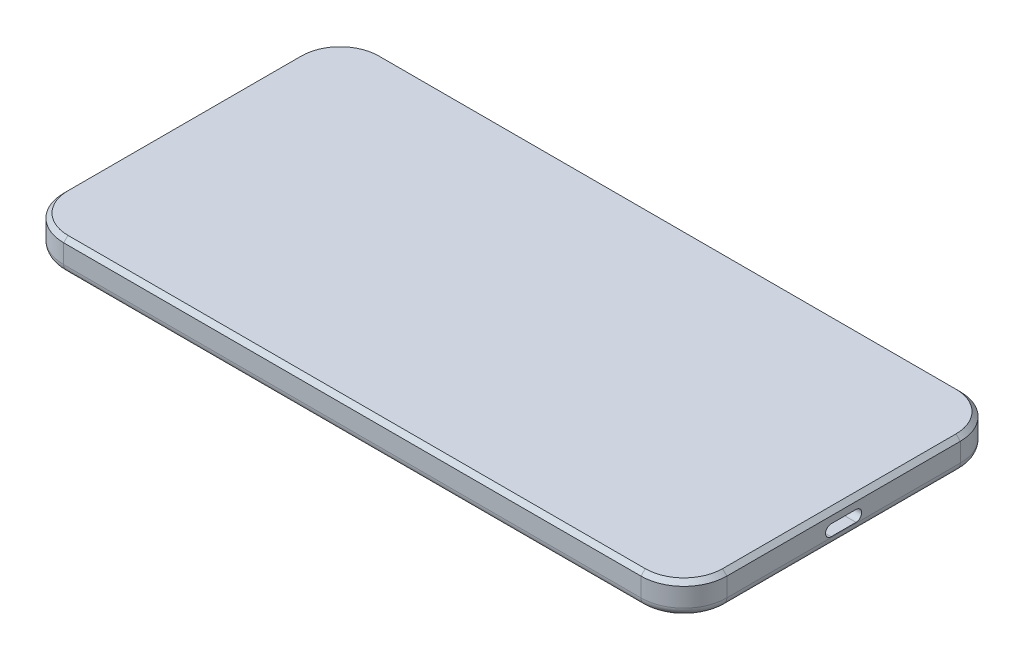
ISO-10303-21;
HEADER;
FILE_DESCRIPTION(('STEP AP214'),'2;1');
FILE_NAME('part.step','',(''),(''),'','','');
FILE_SCHEMA(('AUTOMOTIVE_DESIGN { 1 0 10303 214 1 1 1 1 }'));
ENDSEC;
DATA;
#1=APPLICATION_CONTEXT('core data for automotive mechanical design processes');
#2=APPLICATION_PROTOCOL_DEFINITION('international standard','automotive_design',2000,#1);
#3=PRODUCT_CONTEXT('',#1,'mechanical');
#4=PRODUCT('Part','Part','',(#3));
#5=PRODUCT_RELATED_PRODUCT_CATEGORY('part','',(#4));
#6=PRODUCT_DEFINITION_FORMATION('','',#4);
#7=PRODUCT_DEFINITION_CONTEXT('part definition',#1,'design');
#8=PRODUCT_DEFINITION('design','',#6,#7);
#9=PRODUCT_DEFINITION_SHAPE('','',#8);
#10=(LENGTH_UNIT() NAMED_UNIT(*) SI_UNIT(.MILLI.,.METRE.));
#11=(NAMED_UNIT(*) PLANE_ANGLE_UNIT() SI_UNIT($,.RADIAN.));
#12=(NAMED_UNIT(*) SI_UNIT($,.STERADIAN.) SOLID_ANGLE_UNIT());
#13=UNCERTAINTY_MEASURE_WITH_UNIT(LENGTH_MEASURE(1.E-05),#10,'distance_accuracy_value','');
#14=(GEOMETRIC_REPRESENTATION_CONTEXT(3) GLOBAL_UNCERTAINTY_ASSIGNED_CONTEXT((#13)) GLOBAL_UNIT_ASSIGNED_CONTEXT((#10,
#11,#12)) REPRESENTATION_CONTEXT('',''));
#15=CARTESIAN_POINT('',(0.,0.,0.));
#16=DIRECTION('',(0.,0.,1.));
#17=DIRECTION('',(1.,0.,0.));
#18=AXIS2_PLACEMENT_3D('',#15,#16,#17);
#19=CARTESIAN_POINT('',(0.,0.,0.));
#20=DIRECTION('',(0.,1.,0.));
#21=DIRECTION('',(0.,0.,1.));
#22=AXIS2_PLACEMENT_3D('',#19,#20,#21);
#23=PLANE('',#22);
#24=DIRECTION('',(-1.,0.,0.));
#25=VECTOR('',#24,1.);
#26=CARTESIAN_POINT('',(0.,0.,-35.2));
#27=LINE('',#26,#25);
#28=CARTESIAN_POINT('',(-67.25,0.,-35.2));
#29=VERTEX_POINT('',#28);
#30=CARTESIAN_POINT('',(67.25,0.,-35.2));
#31=VERTEX_POINT('',#30);
#32=EDGE_CURVE('E329',#29,#31,#27,.F.);
#33=ORIENTED_EDGE('',*,*,#32,.T.);
#34=CARTESIAN_POINT('',(67.25,0.,-27.2));
#35=DIRECTION('',(0.,1.,0.));
#36=DIRECTION('',(0.,0.,1.));
#37=AXIS2_PLACEMENT_3D('',#34,#35,#36);
#38=CIRCLE('',#37,8.);
#39=CARTESIAN_POINT('',(75.25,0.,-27.2));
#40=VERTEX_POINT('',#39);
#41=EDGE_CURVE('E365',#31,#40,#38,.F.);
#42=ORIENTED_EDGE('',*,*,#41,.T.);
#43=DIRECTION('',(0.,0.,-1.));
#44=VECTOR('',#43,1.);
#45=CARTESIAN_POINT('',(75.25,0.,0.));
#46=LINE('',#45,#44);
#47=CARTESIAN_POINT('',(75.25,0.,27.2));
#48=VERTEX_POINT('',#47);
#49=EDGE_CURVE('E363',#40,#48,#46,.F.);
#50=ORIENTED_EDGE('',*,*,#49,.T.);
#51=CARTESIAN_POINT('',(67.25,0.,27.2));
#52=DIRECTION('',(0.,1.,0.));
#53=DIRECTION('',(0.,0.,1.));
#54=AXIS2_PLACEMENT_3D('',#51,#52,#53);
#55=CIRCLE('',#54,8.);
#56=CARTESIAN_POINT('',(67.25,0.,35.2));
#57=VERTEX_POINT('',#56);
#58=EDGE_CURVE('E361',#48,#57,#55,.F.);
#59=ORIENTED_EDGE('',*,*,#58,.T.);
#60=DIRECTION('',(1.,0.,0.));
#61=VECTOR('',#60,1.);
#62=CARTESIAN_POINT('',(0.,0.,35.2));
#63=LINE('',#62,#61);
#64=CARTESIAN_POINT('',(-67.25,0.,35.2));
#65=VERTEX_POINT('',#64);
#66=EDGE_CURVE('E359',#57,#65,#63,.F.);
#67=ORIENTED_EDGE('',*,*,#66,.T.);
#68=CARTESIAN_POINT('',(-67.25,0.,27.2));
#69=DIRECTION('',(0.,1.,0.));
#70=DIRECTION('',(0.,0.,1.));
#71=AXIS2_PLACEMENT_3D('',#68,#69,#70);
#72=CIRCLE('',#71,8.);
#73=CARTESIAN_POINT('',(-75.25,0.,27.2));
#74=VERTEX_POINT('',#73);
#75=EDGE_CURVE('E357',#65,#74,#72,.F.);
#76=ORIENTED_EDGE('',*,*,#75,.T.);
#77=DIRECTION('',(0.,0.,1.));
#78=VECTOR('',#77,1.);
#79=CARTESIAN_POINT('',(-75.25,0.,0.));
#80=LINE('',#79,#78);
#81=CARTESIAN_POINT('',(-75.25,0.,-27.2));
#82=VERTEX_POINT('',#81);
#83=EDGE_CURVE('E355',#74,#82,#80,.F.);
#84=ORIENTED_EDGE('',*,*,#83,.T.);
#85=CARTESIAN_POINT('',(-67.25,0.,-27.2));
#86=DIRECTION('',(0.,1.,0.));
#87=DIRECTION('',(0.,0.,1.));
#88=AXIS2_PLACEMENT_3D('',#85,#86,#87);
#89=CIRCLE('',#88,8.);
#90=EDGE_CURVE('E353',#82,#29,#89,.F.);
#91=ORIENTED_EDGE('',*,*,#90,.T.);
#92=EDGE_LOOP('',(#33,#42,#50,#59,#67,#76,#84,#91));
#93=FACE_BOUND('',#92,.T.);
#94=CARTESIAN_POINT('',(-68.95,0.,-13.75));
#95=DIRECTION('',(0.,-1.,0.));
#96=DIRECTION('',(0.,0.,-1.));
#97=AXIS2_PLACEMENT_3D('',#94,#95,#96);
#98=CIRCLE('',#97,4.3);
#99=CARTESIAN_POINT('',(-64.65,0.,-13.75));
#100=VERTEX_POINT('',#99);
#101=CARTESIAN_POINT('',(-73.25,0.,-13.75));
#102=VERTEX_POINT('',#101);
#103=EDGE_CURVE('E252',#100,#102,#98,.T.);
#104=ORIENTED_EDGE('',*,*,#103,.F.);
#105=DIRECTION('',(0.,0.,-1.));
#106=VECTOR('',#105,1.);
#107=CARTESIAN_POINT('',(-64.65,0.,0.));
#108=LINE('',#107,#106);
#109=CARTESIAN_POINT('',(-64.65,0.,-23.65));
#110=VERTEX_POINT('',#109);
#111=EDGE_CURVE('E249',#100,#110,#108,.T.);
#112=ORIENTED_EDGE('',*,*,#111,.T.);
#113=CARTESIAN_POINT('',(-68.95,0.,-23.65));
#114=DIRECTION('',(0.,-1.,0.));
#115=DIRECTION('',(0.,0.,-1.));
#116=AXIS2_PLACEMENT_3D('',#113,#114,#115);
#117=CIRCLE('',#116,4.3);
#118=CARTESIAN_POINT('',(-73.25,0.,-23.65));
#119=VERTEX_POINT('',#118);
#120=EDGE_CURVE('E258',#119,#110,#117,.T.);
#121=ORIENTED_EDGE('',*,*,#120,.F.);
#122=DIRECTION('',(0.,0.,1.));
#123=VECTOR('',#122,1.);
#124=CARTESIAN_POINT('',(-73.25,0.,-1.02681611810344E-13));
#125=LINE('',#124,#123);
#126=EDGE_CURVE('E255',#119,#102,#125,.T.);
#127=ORIENTED_EDGE('',*,*,#126,.T.);
#128=EDGE_LOOP('',(#104,#112,#121,#127));
#129=FACE_BOUND('',#128,.T.);
#130=ADVANCED_FACE('F36',(#93,#129),#23,.F.);
#131=CARTESIAN_POINT('',(77.25,7.4,-37.2));
#132=DIRECTION('',(-1.,0.,0.));
#133=DIRECTION('',(0.,0.,1.));
#134=AXIS2_PLACEMENT_3D('',#131,#132,#133);
#135=PLANE('',#134);
#136=DIRECTION('',(0.,0.,-1.));
#137=VECTOR('',#136,1.);
#138=CARTESIAN_POINT('',(77.25,2.20000000000001,2.90000000000002));
#139=LINE('',#138,#137);
#140=CARTESIAN_POINT('',(77.25,2.20000000000001,2.90000000000001));
#141=VERTEX_POINT('',#140);
#142=CARTESIAN_POINT('',(77.25,2.20000000000001,-2.89999999999999));
#143=VERTEX_POINT('',#142);
#144=EDGE_CURVE('E239',#141,#143,#139,.T.);
#145=ORIENTED_EDGE('',*,*,#144,.F.);
#146=CARTESIAN_POINT('',(77.25,3.5,2.90000000000002));
#147=DIRECTION('',(1.,0.,0.));
#148=DIRECTION('',(0.,0.,-1.));
#149=AXIS2_PLACEMENT_3D('',#146,#147,#148);
#150=CIRCLE('',#149,1.3);
#151=CARTESIAN_POINT('',(77.25,4.8,2.90000000000001));
#152=VERTEX_POINT('',#151);
#153=EDGE_CURVE('E53',#152,#141,#150,.T.);
#154=ORIENTED_EDGE('',*,*,#153,.F.);
#155=DIRECTION('',(0.,0.,1.));
#156=VECTOR('',#155,1.);
#157=CARTESIAN_POINT('',(77.25,4.8,2.90000000000001));
#158=LINE('',#157,#156);
#159=CARTESIAN_POINT('',(77.25,4.8,-2.89999999999999));
#160=VERTEX_POINT('',#159);
#161=EDGE_CURVE('E230',#160,#152,#158,.T.);
#162=ORIENTED_EDGE('',*,*,#161,.F.);
#163=CARTESIAN_POINT('',(77.25,3.5,-2.89999999999999));
#164=DIRECTION('',(1.,0.,0.));
#165=DIRECTION('',(0.,0.,-1.));
#166=AXIS2_PLACEMENT_3D('',#163,#164,#165);
#167=CIRCLE('',#166,1.3);
#168=EDGE_CURVE('E233',#143,#160,#167,.T.);
#169=ORIENTED_EDGE('',*,*,#168,.F.);
#170=EDGE_LOOP('',(#145,#154,#162,#169));
#171=FACE_BOUND('',#170,.T.);
#172=DIRECTION('',(0.,-1.,0.));
#173=VECTOR('',#172,1.);
#174=CARTESIAN_POINT('',(77.25,7.4,27.2));
#175=LINE('',#174,#173);
#176=CARTESIAN_POINT('',(77.25,6.4,27.2));
#177=VERTEX_POINT('',#176);
#178=CARTESIAN_POINT('',(77.25,2.,27.2));
#179=VERTEX_POINT('',#178);
#180=EDGE_CURVE('E281',#177,#179,#175,.T.);
#181=ORIENTED_EDGE('',*,*,#180,.T.);
#182=DIRECTION('',(0.,0.,-1.));
#183=VECTOR('',#182,1.);
#184=CARTESIAN_POINT('',(77.25,2.,-37.2));
#185=LINE('',#184,#183);
#186=CARTESIAN_POINT('',(77.25,2.,-27.2));
#187=VERTEX_POINT('',#186);
#188=EDGE_CURVE('E371',#179,#187,#185,.T.);
#189=ORIENTED_EDGE('',*,*,#188,.T.);
#190=DIRECTION('',(0.,-1.,0.));
#191=VECTOR('',#190,1.);
#192=CARTESIAN_POINT('',(77.25,7.4,-27.2));
#193=LINE('',#192,#191);
#194=CARTESIAN_POINT('',(77.25,6.4,-27.2));
#195=VERTEX_POINT('',#194);
#196=EDGE_CURVE('E284',#187,#195,#193,.F.);
#197=ORIENTED_EDGE('',*,*,#196,.T.);
#198=DIRECTION('',(0.,0.,1.));
#199=VECTOR('',#198,1.);
#200=CARTESIAN_POINT('',(77.25,6.4,27.2));
#201=LINE('',#200,#199);
#202=EDGE_CURVE('E317',#195,#177,#201,.T.);
#203=ORIENTED_EDGE('',*,*,#202,.T.);
#204=EDGE_LOOP('',(#181,#189,#197,#203));
#205=FACE_BOUND('',#204,.T.);
#206=ADVANCED_FACE('F469',(#171,#205),#135,.F.);
#207=CARTESIAN_POINT('',(-77.25,7.4,-37.2));
#208=DIRECTION('',(0.,0.,1.));
#209=DIRECTION('',(1.,0.,0.));
#210=AXIS2_PLACEMENT_3D('',#207,#208,#209);
#211=PLANE('',#210);
#212=DIRECTION('',(0.,-1.,0.));
#213=VECTOR('',#212,1.);
#214=CARTESIAN_POINT('',(67.25,7.4,-37.2));
#215=LINE('',#214,#213);
#216=CARTESIAN_POINT('',(67.25,6.4,-37.2));
#217=VERTEX_POINT('',#216);
#218=CARTESIAN_POINT('',(67.25,2.,-37.2));
#219=VERTEX_POINT('',#218);
#220=EDGE_CURVE('E276',#217,#219,#215,.T.);
#221=ORIENTED_EDGE('',*,*,#220,.T.);
#222=DIRECTION('',(-1.,0.,0.));
#223=VECTOR('',#222,1.);
#224=CARTESIAN_POINT('',(-77.25,2.,-37.2));
#225=LINE('',#224,#223);
#226=CARTESIAN_POINT('',(-67.25,2.,-37.2));
#227=VERTEX_POINT('',#226);
#228=EDGE_CURVE('E383',#219,#227,#225,.T.);
#229=ORIENTED_EDGE('',*,*,#228,.T.);
#230=DIRECTION('',(0.,-1.,0.));
#231=VECTOR('',#230,1.);
#232=CARTESIAN_POINT('',(-67.25,7.4,-37.2));
#233=LINE('',#232,#231);
#234=CARTESIAN_POINT('',(-67.25,6.4,-37.2));
#235=VERTEX_POINT('',#234);
#236=EDGE_CURVE('E279',#227,#235,#233,.F.);
#237=ORIENTED_EDGE('',*,*,#236,.T.);
#238=DIRECTION('',(1.,0.,0.));
#239=VECTOR('',#238,1.);
#240=CARTESIAN_POINT('',(67.25,6.4,-37.2));
#241=LINE('',#240,#239);
#242=EDGE_CURVE('E327',#235,#217,#241,.T.);
#243=ORIENTED_EDGE('',*,*,#242,.T.);
#244=EDGE_LOOP('',(#221,#229,#237,#243));
#245=FACE_BOUND('',#244,.T.);
#246=ADVANCED_FACE('F475',(#245),#211,.F.);
#247=CARTESIAN_POINT('',(-77.25,7.4,-37.2));
#248=DIRECTION('',(1.,0.,0.));
#249=DIRECTION('',(0.,0.,-1.));
#250=AXIS2_PLACEMENT_3D('',#247,#248,#249);
#251=PLANE('',#250);
#252=DIRECTION('',(0.,-1.,0.));
#253=VECTOR('',#252,1.);
#254=CARTESIAN_POINT('',(-77.25,7.4,-27.2));
#255=LINE('',#254,#253);
#256=CARTESIAN_POINT('',(-77.25,6.4,-27.2));
#257=VERTEX_POINT('',#256);
#258=CARTESIAN_POINT('',(-77.25,2.,-27.2));
#259=VERTEX_POINT('',#258);
#260=EDGE_CURVE('E272',#257,#259,#255,.T.);
#261=ORIENTED_EDGE('',*,*,#260,.T.);
#262=DIRECTION('',(0.,0.,1.));
#263=VECTOR('',#262,1.);
#264=CARTESIAN_POINT('',(-77.25,2.,-37.2));
#265=LINE('',#264,#263);
#266=CARTESIAN_POINT('',(-77.25,2.,27.2));
#267=VERTEX_POINT('',#266);
#268=EDGE_CURVE('E379',#259,#267,#265,.T.);
#269=ORIENTED_EDGE('',*,*,#268,.T.);
#270=DIRECTION('',(0.,-1.,0.));
#271=VECTOR('',#270,1.);
#272=CARTESIAN_POINT('',(-77.25,7.4,27.2));
#273=LINE('',#272,#271);
#274=CARTESIAN_POINT('',(-77.25,6.4,27.2));
#275=VERTEX_POINT('',#274);
#276=EDGE_CURVE('E270',#267,#275,#273,.F.);
#277=ORIENTED_EDGE('',*,*,#276,.T.);
#278=DIRECTION('',(0.,0.,-1.));
#279=VECTOR('',#278,1.);
#280=CARTESIAN_POINT('',(-77.25,6.4,-27.2));
#281=LINE('',#280,#279);
#282=EDGE_CURVE('E319',#275,#257,#281,.T.);
#283=ORIENTED_EDGE('',*,*,#282,.T.);
#284=EDGE_LOOP('',(#261,#269,#277,#283));
#285=FACE_BOUND('',#284,.T.);
#286=ADVANCED_FACE('F484',(#285),#251,.F.);
#287=CARTESIAN_POINT('',(-77.25,7.4,37.2));
#288=DIRECTION('',(0.,0.,-1.));
#289=DIRECTION('',(-1.,0.,0.));
#290=AXIS2_PLACEMENT_3D('',#287,#288,#289);
#291=PLANE('',#290);
#292=DIRECTION('',(0.,-1.,0.));
#293=VECTOR('',#292,1.);
#294=CARTESIAN_POINT('',(-67.25,7.4,37.2));
#295=LINE('',#294,#293);
#296=CARTESIAN_POINT('',(-67.25,6.4,37.2));
#297=VERTEX_POINT('',#296);
#298=CARTESIAN_POINT('',(-67.25,2.,37.2));
#299=VERTEX_POINT('',#298);
#300=EDGE_CURVE('E288',#297,#299,#295,.T.);
#301=ORIENTED_EDGE('',*,*,#300,.T.);
#302=DIRECTION('',(1.,0.,0.));
#303=VECTOR('',#302,1.);
#304=CARTESIAN_POINT('',(-77.25,2.,37.2));
#305=LINE('',#304,#303);
#306=CARTESIAN_POINT('',(67.25,2.,37.2));
#307=VERTEX_POINT('',#306);
#308=EDGE_CURVE('E375',#299,#307,#305,.T.);
#309=ORIENTED_EDGE('',*,*,#308,.T.);
#310=DIRECTION('',(0.,-1.,0.));
#311=VECTOR('',#310,1.);
#312=CARTESIAN_POINT('',(67.25,7.4,37.2));
#313=LINE('',#312,#311);
#314=CARTESIAN_POINT('',(67.25,6.4,37.2));
#315=VERTEX_POINT('',#314);
#316=EDGE_CURVE('E286',#307,#315,#313,.F.);
#317=ORIENTED_EDGE('',*,*,#316,.T.);
#318=DIRECTION('',(-1.,0.,0.));
#319=VECTOR('',#318,1.);
#320=CARTESIAN_POINT('',(-67.25,6.4,37.2));
#321=LINE('',#320,#319);
#322=EDGE_CURVE('E308',#315,#297,#321,.T.);
#323=ORIENTED_EDGE('',*,*,#322,.T.);
#324=EDGE_LOOP('',(#301,#309,#317,#323));
#325=FACE_BOUND('',#324,.T.);
#326=ADVANCED_FACE('F481',(#325),#291,.F.);
#327=CARTESIAN_POINT('',(0.,7.4,0.));
#328=DIRECTION('',(0.,1.,0.));
#329=DIRECTION('',(0.,0.,1.));
#330=AXIS2_PLACEMENT_3D('',#327,#328,#329);
#331=PLANE('',#330);
#332=CARTESIAN_POINT('',(-67.25,7.4,27.2));
#333=DIRECTION('',(0.,1.,0.));
#334=DIRECTION('',(0.,0.,1.));
#335=AXIS2_PLACEMENT_3D('',#332,#333,#334);
#336=CIRCLE('',#335,8.99999999999999);
#337=CARTESIAN_POINT('',(-76.25,7.4,27.2));
#338=VERTEX_POINT('',#337);
#339=CARTESIAN_POINT('',(-67.25,7.4,36.2));
#340=VERTEX_POINT('',#339);
#341=EDGE_CURVE('E301',#338,#340,#336,.T.);
#342=ORIENTED_EDGE('',*,*,#341,.T.);
#343=DIRECTION('',(1.,0.,0.));
#344=VECTOR('',#343,1.);
#345=CARTESIAN_POINT('',(67.25,7.4,36.2));
#346=LINE('',#345,#344);
#347=CARTESIAN_POINT('',(67.25,7.4,36.2));
#348=VERTEX_POINT('',#347);
#349=EDGE_CURVE('E305',#340,#348,#346,.T.);
#350=ORIENTED_EDGE('',*,*,#349,.T.);
#351=CARTESIAN_POINT('',(67.25,7.4,27.2));
#352=DIRECTION('',(0.,1.,0.));
#353=DIRECTION('',(0.,0.,1.));
#354=AXIS2_PLACEMENT_3D('',#351,#352,#353);
#355=CIRCLE('',#354,8.99999999999999);
#356=CARTESIAN_POINT('',(76.25,7.4,27.2));
#357=VERTEX_POINT('',#356);
#358=EDGE_CURVE('E303',#348,#357,#355,.T.);
#359=ORIENTED_EDGE('',*,*,#358,.T.);
#360=DIRECTION('',(0.,0.,-1.));
#361=VECTOR('',#360,1.);
#362=CARTESIAN_POINT('',(76.25,7.4,-27.2));
#363=LINE('',#362,#361);
#364=CARTESIAN_POINT('',(76.25,7.4,-27.2));
#365=VERTEX_POINT('',#364);
#366=EDGE_CURVE('E299',#357,#365,#363,.T.);
#367=ORIENTED_EDGE('',*,*,#366,.T.);
#368=CARTESIAN_POINT('',(67.25,7.4,-27.2));
#369=DIRECTION('',(0.,1.,0.));
#370=DIRECTION('',(0.,0.,1.));
#371=AXIS2_PLACEMENT_3D('',#368,#369,#370);
#372=CIRCLE('',#371,8.99999999999999);
#373=CARTESIAN_POINT('',(67.25,7.4,-36.2));
#374=VERTEX_POINT('',#373);
#375=EDGE_CURVE('E295',#365,#374,#372,.T.);
#376=ORIENTED_EDGE('',*,*,#375,.T.);
#377=DIRECTION('',(-1.,0.,0.));
#378=VECTOR('',#377,1.);
#379=CARTESIAN_POINT('',(-67.25,7.4,-36.2));
#380=LINE('',#379,#378);
#381=CARTESIAN_POINT('',(-67.25,7.4,-36.2));
#382=VERTEX_POINT('',#381);
#383=EDGE_CURVE('E291',#374,#382,#380,.T.);
#384=ORIENTED_EDGE('',*,*,#383,.T.);
#385=CARTESIAN_POINT('',(-67.25,7.4,-27.2));
#386=DIRECTION('',(0.,1.,0.));
#387=DIRECTION('',(0.,0.,1.));
#388=AXIS2_PLACEMENT_3D('',#385,#386,#387);
#389=CIRCLE('',#388,8.99999999999999);
#390=CARTESIAN_POINT('',(-76.25,7.4,-27.2));
#391=VERTEX_POINT('',#390);
#392=EDGE_CURVE('E293',#382,#391,#389,.T.);
#393=ORIENTED_EDGE('',*,*,#392,.T.);
#394=DIRECTION('',(0.,0.,1.));
#395=VECTOR('',#394,1.);
#396=CARTESIAN_POINT('',(-76.25,7.4,27.2));
#397=LINE('',#396,#395);
#398=EDGE_CURVE('E297',#391,#338,#397,.T.);
#399=ORIENTED_EDGE('',*,*,#398,.T.);
#400=EDGE_LOOP('',(#342,#350,#359,#367,#376,#384,#393,#399));
#401=FACE_BOUND('',#400,.T.);
#402=ADVANCED_FACE('F480',(#401),#331,.T.);
#403=CARTESIAN_POINT('',(-67.25,7.4,-27.2));
#404=DIRECTION('',(0.,-1.,0.));
#405=DIRECTION('',(0.,0.,-1.));
#406=AXIS2_PLACEMENT_3D('',#403,#404,#405);
#407=CYLINDRICAL_SURFACE('',#406,10.);
#408=ORIENTED_EDGE('',*,*,#236,.F.);
#409=CARTESIAN_POINT('',(-67.25,2.,-27.2));
#410=DIRECTION('',(0.,1.,0.));
#411=DIRECTION('',(0.,0.,1.));
#412=AXIS2_PLACEMENT_3D('',#409,#410,#411);
#413=CIRCLE('',#412,10.);
#414=EDGE_CURVE('E381',#227,#259,#413,.T.);
#415=ORIENTED_EDGE('',*,*,#414,.T.);
#416=ORIENTED_EDGE('',*,*,#260,.F.);
#417=CARTESIAN_POINT('',(-67.25,6.4,-27.2));
#418=DIRECTION('',(0.,1.,0.));
#419=DIRECTION('',(0.,0.,1.));
#420=AXIS2_PLACEMENT_3D('',#417,#418,#419);
#421=CIRCLE('',#420,10.);
#422=EDGE_CURVE('E324',#257,#235,#421,.F.);
#423=ORIENTED_EDGE('',*,*,#422,.T.);
#424=EDGE_LOOP('',(#408,#415,#416,#423));
#425=FACE_BOUND('',#424,.T.);
#426=ADVANCED_FACE('F492',(#425),#407,.T.);
#427=CARTESIAN_POINT('',(67.25,7.4,-27.2));
#428=DIRECTION('',(0.,-1.,0.));
#429=DIRECTION('',(0.,0.,-1.));
#430=AXIS2_PLACEMENT_3D('',#427,#428,#429);
#431=CYLINDRICAL_SURFACE('',#430,10.);
#432=ORIENTED_EDGE('',*,*,#196,.F.);
#433=CARTESIAN_POINT('',(67.25,2.,-27.2));
#434=DIRECTION('',(0.,1.,0.));
#435=DIRECTION('',(0.,0.,1.));
#436=AXIS2_PLACEMENT_3D('',#433,#434,#435);
#437=CIRCLE('',#436,10.);
#438=EDGE_CURVE('E368',#187,#219,#437,.T.);
#439=ORIENTED_EDGE('',*,*,#438,.T.);
#440=ORIENTED_EDGE('',*,*,#220,.F.);
#441=CARTESIAN_POINT('',(67.25,6.4,-27.2));
#442=DIRECTION('',(0.,1.,0.));
#443=DIRECTION('',(0.,0.,1.));
#444=AXIS2_PLACEMENT_3D('',#441,#442,#443);
#445=CIRCLE('',#444,10.);
#446=EDGE_CURVE('E321',#217,#195,#445,.F.);
#447=ORIENTED_EDGE('',*,*,#446,.T.);
#448=EDGE_LOOP('',(#432,#439,#440,#447));
#449=FACE_BOUND('',#448,.T.);
#450=ADVANCED_FACE('F495',(#449),#431,.T.);
#451=CARTESIAN_POINT('',(-67.25,7.4,27.2));
#452=DIRECTION('',(0.,-1.,0.));
#453=DIRECTION('',(0.,0.,-1.));
#454=AXIS2_PLACEMENT_3D('',#451,#452,#453);
#455=CYLINDRICAL_SURFACE('',#454,10.);
#456=ORIENTED_EDGE('',*,*,#276,.F.);
#457=CARTESIAN_POINT('',(-67.25,2.,27.2));
#458=DIRECTION('',(0.,1.,0.));
#459=DIRECTION('',(0.,0.,1.));
#460=AXIS2_PLACEMENT_3D('',#457,#458,#459);
#461=CIRCLE('',#460,10.);
#462=EDGE_CURVE('E377',#267,#299,#461,.T.);
#463=ORIENTED_EDGE('',*,*,#462,.T.);
#464=ORIENTED_EDGE('',*,*,#300,.F.);
#465=CARTESIAN_POINT('',(-67.25,6.4,27.2));
#466=DIRECTION('',(0.,1.,0.));
#467=DIRECTION('',(0.,0.,1.));
#468=AXIS2_PLACEMENT_3D('',#465,#466,#467);
#469=CIRCLE('',#468,10.);
#470=EDGE_CURVE('E314',#297,#275,#469,.F.);
#471=ORIENTED_EDGE('',*,*,#470,.T.);
#472=EDGE_LOOP('',(#456,#463,#464,#471));
#473=FACE_BOUND('',#472,.T.);
#474=ADVANCED_FACE('F499',(#473),#455,.T.);
#475=CARTESIAN_POINT('',(67.25,7.4,27.2));
#476=DIRECTION('',(0.,-1.,0.));
#477=DIRECTION('',(0.,0.,-1.));
#478=AXIS2_PLACEMENT_3D('',#475,#476,#477);
#479=CYLINDRICAL_SURFACE('',#478,10.);
#480=ORIENTED_EDGE('',*,*,#316,.F.);
#481=CARTESIAN_POINT('',(67.25,2.,27.2));
#482=DIRECTION('',(0.,1.,0.));
#483=DIRECTION('',(0.,0.,1.));
#484=AXIS2_PLACEMENT_3D('',#481,#482,#483);
#485=CIRCLE('',#484,10.);
#486=EDGE_CURVE('E373',#307,#179,#485,.T.);
#487=ORIENTED_EDGE('',*,*,#486,.T.);
#488=ORIENTED_EDGE('',*,*,#180,.F.);
#489=CARTESIAN_POINT('',(67.25,6.4,27.2));
#490=DIRECTION('',(0.,1.,0.));
#491=DIRECTION('',(0.,0.,1.));
#492=AXIS2_PLACEMENT_3D('',#489,#490,#491);
#493=CIRCLE('',#492,10.);
#494=EDGE_CURVE('E311',#177,#315,#493,.F.);
#495=ORIENTED_EDGE('',*,*,#494,.T.);
#496=EDGE_LOOP('',(#480,#487,#488,#495));
#497=FACE_BOUND('',#496,.T.);
#498=ADVANCED_FACE('F503',(#497),#479,.T.);
#499=CARTESIAN_POINT('',(0.,7.4,-36.2));
#500=DIRECTION('',(0.,0.707106781186547,-0.707106781186547));
#501=DIRECTION('',(1.,0.,0.));
#502=AXIS2_PLACEMENT_3D('',#499,#500,#501);
#503=PLANE('',#502);
#504=DIRECTION('',(0.,0.707106781186547,0.707106781186547));
#505=VECTOR('',#504,1.);
#506=CARTESIAN_POINT('',(67.25,6.4,-37.2));
#507=LINE('',#506,#505);
#508=EDGE_CURVE('E347',#217,#374,#507,.T.);
#509=ORIENTED_EDGE('',*,*,#508,.F.);
#510=ORIENTED_EDGE('',*,*,#242,.F.);
#511=DIRECTION('',(0.,-0.707106781186547,-0.707106781186547));
#512=VECTOR('',#511,1.);
#513=CARTESIAN_POINT('',(-67.25,7.4,-36.2));
#514=LINE('',#513,#512);
#515=EDGE_CURVE('E273',#382,#235,#514,.T.);
#516=ORIENTED_EDGE('',*,*,#515,.F.);
#517=ORIENTED_EDGE('',*,*,#383,.F.);
#518=EDGE_LOOP('',(#509,#510,#516,#517));
#519=FACE_BOUND('',#518,.T.);
#520=ADVANCED_FACE('F507',(#519),#503,.T.);
#521=CARTESIAN_POINT('',(-67.25,7.4,-27.2));
#522=DIRECTION('',(0.,-1.,0.));
#523=DIRECTION('',(0.,0.,-1.));
#524=AXIS2_PLACEMENT_3D('',#521,#522,#523);
#525=CONICAL_SURFACE('',#524,9.,0.785398163397447);
#526=ORIENTED_EDGE('',*,*,#515,.T.);
#527=ORIENTED_EDGE('',*,*,#422,.F.);
#528=DIRECTION('',(-0.707106781186547,-0.707106781186547,0.));
#529=VECTOR('',#528,1.);
#530=CARTESIAN_POINT('',(-76.25,7.4,-27.2));
#531=LINE('',#530,#529);
#532=EDGE_CURVE('E344',#391,#257,#531,.T.);
#533=ORIENTED_EDGE('',*,*,#532,.F.);
#534=ORIENTED_EDGE('',*,*,#392,.F.);
#535=EDGE_LOOP('',(#526,#527,#533,#534));
#536=FACE_BOUND('',#535,.T.);
#537=ADVANCED_FACE('F533',(#536),#525,.T.);
#538=CARTESIAN_POINT('',(67.25,7.4,-27.2));
#539=DIRECTION('',(0.,-1.,0.));
#540=DIRECTION('',(0.,0.,-1.));
#541=AXIS2_PLACEMENT_3D('',#538,#539,#540);
#542=CONICAL_SURFACE('',#541,8.99999999999999,0.785398163397451);
#543=ORIENTED_EDGE('',*,*,#508,.T.);
#544=ORIENTED_EDGE('',*,*,#375,.F.);
#545=DIRECTION('',(-0.707106781186547,0.707106781186547,0.));
#546=VECTOR('',#545,1.);
#547=CARTESIAN_POINT('',(77.25,6.4,-27.2));
#548=LINE('',#547,#546);
#549=EDGE_CURVE('E341',#195,#365,#548,.T.);
#550=ORIENTED_EDGE('',*,*,#549,.F.);
#551=ORIENTED_EDGE('',*,*,#446,.F.);
#552=EDGE_LOOP('',(#543,#544,#550,#551));
#553=FACE_BOUND('',#552,.T.);
#554=ADVANCED_FACE('F529',(#553),#542,.T.);
#555=CARTESIAN_POINT('',(-76.25,7.4,0.));
#556=DIRECTION('',(-0.707106781186547,0.707106781186547,0.));
#557=DIRECTION('',(0.,0.,-1.));
#558=AXIS2_PLACEMENT_3D('',#555,#556,#557);
#559=PLANE('',#558);
#560=ORIENTED_EDGE('',*,*,#532,.T.);
#561=ORIENTED_EDGE('',*,*,#282,.F.);
#562=DIRECTION('',(-0.707106781186547,-0.707106781186547,0.));
#563=VECTOR('',#562,1.);
#564=CARTESIAN_POINT('',(-76.25,7.4,27.2));
#565=LINE('',#564,#563);
#566=EDGE_CURVE('E338',#338,#275,#565,.T.);
#567=ORIENTED_EDGE('',*,*,#566,.F.);
#568=ORIENTED_EDGE('',*,*,#398,.F.);
#569=EDGE_LOOP('',(#560,#561,#567,#568));
#570=FACE_BOUND('',#569,.T.);
#571=ADVANCED_FACE('F525',(#570),#559,.T.);
#572=CARTESIAN_POINT('',(76.25,7.4,0.));
#573=DIRECTION('',(0.70710678118655,0.707106781186545,0.));
#574=DIRECTION('',(0.,0.,1.));
#575=AXIS2_PLACEMENT_3D('',#572,#573,#574);
#576=PLANE('',#575);
#577=ORIENTED_EDGE('',*,*,#549,.T.);
#578=ORIENTED_EDGE('',*,*,#366,.F.);
#579=DIRECTION('',(-0.707106781186547,0.707106781186547,0.));
#580=VECTOR('',#579,1.);
#581=CARTESIAN_POINT('',(77.25,6.4,27.2));
#582=LINE('',#581,#580);
#583=EDGE_CURVE('E335',#177,#357,#582,.T.);
#584=ORIENTED_EDGE('',*,*,#583,.F.);
#585=ORIENTED_EDGE('',*,*,#202,.F.);
#586=EDGE_LOOP('',(#577,#578,#584,#585));
#587=FACE_BOUND('',#586,.T.);
#588=ADVANCED_FACE('F521',(#587),#576,.T.);
#589=CARTESIAN_POINT('',(-67.25,7.4,27.2));
#590=DIRECTION('',(0.,-1.,0.));
#591=DIRECTION('',(0.,0.,-1.));
#592=AXIS2_PLACEMENT_3D('',#589,#590,#591);
#593=CONICAL_SURFACE('',#592,8.99999999999999,0.785398163397451);
#594=ORIENTED_EDGE('',*,*,#566,.T.);
#595=ORIENTED_EDGE('',*,*,#470,.F.);
#596=DIRECTION('',(0.,-0.707106781186545,0.70710678118655));
#597=VECTOR('',#596,1.);
#598=CARTESIAN_POINT('',(-67.25,7.4,36.2));
#599=LINE('',#598,#597);
#600=EDGE_CURVE('E332',#340,#297,#599,.T.);
#601=ORIENTED_EDGE('',*,*,#600,.F.);
#602=ORIENTED_EDGE('',*,*,#341,.F.);
#603=EDGE_LOOP('',(#594,#595,#601,#602));
#604=FACE_BOUND('',#603,.T.);
#605=ADVANCED_FACE('F517',(#604),#593,.T.);
#606=CARTESIAN_POINT('',(67.25,7.4,27.2));
#607=DIRECTION('',(0.,-1.,0.));
#608=DIRECTION('',(0.,0.,-1.));
#609=AXIS2_PLACEMENT_3D('',#606,#607,#608);
#610=CONICAL_SURFACE('',#609,9.,0.785398163397447);
#611=ORIENTED_EDGE('',*,*,#583,.T.);
#612=ORIENTED_EDGE('',*,*,#358,.F.);
#613=DIRECTION('',(0.,0.707106781186545,-0.70710678118655));
#614=VECTOR('',#613,1.);
#615=CARTESIAN_POINT('',(67.25,6.4,37.2));
#616=LINE('',#615,#614);
#617=EDGE_CURVE('E330',#315,#348,#616,.T.);
#618=ORIENTED_EDGE('',*,*,#617,.F.);
#619=ORIENTED_EDGE('',*,*,#494,.F.);
#620=EDGE_LOOP('',(#611,#612,#618,#619));
#621=FACE_BOUND('',#620,.T.);
#622=ADVANCED_FACE('F513',(#621),#610,.T.);
#623=CARTESIAN_POINT('',(0.,7.4,36.2));
#624=DIRECTION('',(0.,0.707106781186547,0.707106781186547));
#625=DIRECTION('',(-1.,0.,0.));
#626=AXIS2_PLACEMENT_3D('',#623,#624,#625);
#627=PLANE('',#626);
#628=ORIENTED_EDGE('',*,*,#600,.T.);
#629=ORIENTED_EDGE('',*,*,#322,.F.);
#630=ORIENTED_EDGE('',*,*,#617,.T.);
#631=ORIENTED_EDGE('',*,*,#349,.F.);
#632=EDGE_LOOP('',(#628,#629,#630,#631));
#633=FACE_BOUND('',#632,.T.);
#634=ADVANCED_FACE('F509',(#633),#627,.T.);
#635=CARTESIAN_POINT('',(-67.25,2.,27.2));
#636=DIRECTION('',(0.,1.,0.));
#637=DIRECTION('',(0.,0.,1.));
#638=AXIS2_PLACEMENT_3D('',#635,#636,#637);
#639=TOROIDAL_SURFACE('',#638,8.,2.);
#640=CARTESIAN_POINT('',(-67.25,2.,35.2));
#641=DIRECTION('',(1.,0.,0.));
#642=DIRECTION('',(0.,0.,-1.));
#643=AXIS2_PLACEMENT_3D('',#640,#641,#642);
#644=CIRCLE('',#643,2.);
#645=EDGE_CURVE('E401',#299,#65,#644,.T.);
#646=ORIENTED_EDGE('',*,*,#645,.F.);
#647=ORIENTED_EDGE('',*,*,#462,.F.);
#648=CARTESIAN_POINT('',(-75.25,2.,27.2));
#649=DIRECTION('',(0.,0.,-1.));
#650=DIRECTION('',(-1.,0.,0.));
#651=AXIS2_PLACEMENT_3D('',#648,#649,#650);
#652=CIRCLE('',#651,2.);
#653=EDGE_CURVE('E333',#74,#267,#652,.T.);
#654=ORIENTED_EDGE('',*,*,#653,.F.);
#655=ORIENTED_EDGE('',*,*,#75,.F.);
#656=EDGE_LOOP('',(#646,#647,#654,#655));
#657=FACE_BOUND('',#656,.T.);
#658=ADVANCED_FACE('F512',(#657),#639,.T.);
#659=CARTESIAN_POINT('',(-75.25,2.,-37.2));
#660=DIRECTION('',(0.,0.,1.));
#661=DIRECTION('',(1.,0.,0.));
#662=AXIS2_PLACEMENT_3D('',#659,#660,#661);
#663=CYLINDRICAL_SURFACE('',#662,2.);
#664=ORIENTED_EDGE('',*,*,#653,.T.);
#665=ORIENTED_EDGE('',*,*,#268,.F.);
#666=CARTESIAN_POINT('',(-75.25,2.,-27.2));
#667=DIRECTION('',(0.,0.,-1.));
#668=DIRECTION('',(-1.,0.,0.));
#669=AXIS2_PLACEMENT_3D('',#666,#667,#668);
#670=CIRCLE('',#669,2.);
#671=EDGE_CURVE('E398',#82,#259,#670,.T.);
#672=ORIENTED_EDGE('',*,*,#671,.F.);
#673=ORIENTED_EDGE('',*,*,#83,.F.);
#674=EDGE_LOOP('',(#664,#665,#672,#673));
#675=FACE_BOUND('',#674,.T.);
#676=ADVANCED_FACE('F563',(#675),#663,.T.);
#677=CARTESIAN_POINT('',(-77.25,2.,35.2));
#678=DIRECTION('',(1.,0.,0.));
#679=DIRECTION('',(0.,0.,-1.));
#680=AXIS2_PLACEMENT_3D('',#677,#678,#679);
#681=CYLINDRICAL_SURFACE('',#680,2.);
#682=ORIENTED_EDGE('',*,*,#645,.T.);
#683=ORIENTED_EDGE('',*,*,#66,.F.);
#684=CARTESIAN_POINT('',(67.25,2.,35.2));
#685=DIRECTION('',(1.,0.,0.));
#686=DIRECTION('',(0.,0.,-1.));
#687=AXIS2_PLACEMENT_3D('',#684,#685,#686);
#688=CIRCLE('',#687,2.);
#689=EDGE_CURVE('E395',#307,#57,#688,.T.);
#690=ORIENTED_EDGE('',*,*,#689,.F.);
#691=ORIENTED_EDGE('',*,*,#308,.F.);
#692=EDGE_LOOP('',(#682,#683,#690,#691));
#693=FACE_BOUND('',#692,.T.);
#694=ADVANCED_FACE('F559',(#693),#681,.T.);
#695=CARTESIAN_POINT('',(-67.25,2.,-27.2));
#696=DIRECTION('',(0.,1.,0.));
#697=DIRECTION('',(0.,0.,1.));
#698=AXIS2_PLACEMENT_3D('',#695,#696,#697);
#699=TOROIDAL_SURFACE('',#698,8.,2.);
#700=ORIENTED_EDGE('',*,*,#671,.T.);
#701=ORIENTED_EDGE('',*,*,#414,.F.);
#702=CARTESIAN_POINT('',(-67.25,2.,-35.2));
#703=DIRECTION('',(1.,0.,0.));
#704=DIRECTION('',(0.,0.,-1.));
#705=AXIS2_PLACEMENT_3D('',#702,#703,#704);
#706=CIRCLE('',#705,2.);
#707=EDGE_CURVE('E392',#29,#227,#706,.T.);
#708=ORIENTED_EDGE('',*,*,#707,.F.);
#709=ORIENTED_EDGE('',*,*,#90,.F.);
#710=EDGE_LOOP('',(#700,#701,#708,#709));
#711=FACE_BOUND('',#710,.T.);
#712=ADVANCED_FACE('F555',(#711),#699,.T.);
#713=CARTESIAN_POINT('',(67.25,2.,27.2));
#714=DIRECTION('',(0.,1.,0.));
#715=DIRECTION('',(0.,0.,1.));
#716=AXIS2_PLACEMENT_3D('',#713,#714,#715);
#717=TOROIDAL_SURFACE('',#716,8.,2.);
#718=ORIENTED_EDGE('',*,*,#689,.T.);
#719=ORIENTED_EDGE('',*,*,#58,.F.);
#720=CARTESIAN_POINT('',(75.25,2.,27.2));
#721=DIRECTION('',(0.,0.,-1.));
#722=DIRECTION('',(-1.,0.,0.));
#723=AXIS2_PLACEMENT_3D('',#720,#721,#722);
#724=CIRCLE('',#723,2.);
#725=EDGE_CURVE('E389',#179,#48,#724,.T.);
#726=ORIENTED_EDGE('',*,*,#725,.F.);
#727=ORIENTED_EDGE('',*,*,#486,.F.);
#728=EDGE_LOOP('',(#718,#719,#726,#727));
#729=FACE_BOUND('',#728,.T.);
#730=ADVANCED_FACE('F551',(#729),#717,.T.);
#731=CARTESIAN_POINT('',(-77.25,2.,-35.2));
#732=DIRECTION('',(-1.,0.,0.));
#733=DIRECTION('',(0.,0.,1.));
#734=AXIS2_PLACEMENT_3D('',#731,#732,#733);
#735=CYLINDRICAL_SURFACE('',#734,2.);
#736=ORIENTED_EDGE('',*,*,#707,.T.);
#737=ORIENTED_EDGE('',*,*,#228,.F.);
#738=CARTESIAN_POINT('',(67.25,2.,-35.2));
#739=DIRECTION('',(1.,0.,0.));
#740=DIRECTION('',(0.,0.,-1.));
#741=AXIS2_PLACEMENT_3D('',#738,#739,#740);
#742=CIRCLE('',#741,2.);
#743=EDGE_CURVE('E387',#31,#219,#742,.T.);
#744=ORIENTED_EDGE('',*,*,#743,.F.);
#745=ORIENTED_EDGE('',*,*,#32,.F.);
#746=EDGE_LOOP('',(#736,#737,#744,#745));
#747=FACE_BOUND('',#746,.T.);
#748=ADVANCED_FACE('F547',(#747),#735,.T.);
#749=CARTESIAN_POINT('',(75.25,2.,-37.2));
#750=DIRECTION('',(0.,0.,-1.));
#751=DIRECTION('',(-1.,0.,0.));
#752=AXIS2_PLACEMENT_3D('',#749,#750,#751);
#753=CYLINDRICAL_SURFACE('',#752,2.);
#754=ORIENTED_EDGE('',*,*,#725,.T.);
#755=ORIENTED_EDGE('',*,*,#49,.F.);
#756=CARTESIAN_POINT('',(75.25,2.,-27.2));
#757=DIRECTION('',(0.,0.,-1.));
#758=DIRECTION('',(-1.,0.,0.));
#759=AXIS2_PLACEMENT_3D('',#756,#757,#758);
#760=CIRCLE('',#759,2.);
#761=EDGE_CURVE('E269',#187,#40,#760,.T.);
#762=ORIENTED_EDGE('',*,*,#761,.F.);
#763=ORIENTED_EDGE('',*,*,#188,.F.);
#764=EDGE_LOOP('',(#754,#755,#762,#763));
#765=FACE_BOUND('',#764,.T.);
#766=ADVANCED_FACE('F543',(#765),#753,.T.);
#767=CARTESIAN_POINT('',(67.25,2.,-27.2));
#768=DIRECTION('',(0.,1.,0.));
#769=DIRECTION('',(0.,0.,1.));
#770=AXIS2_PLACEMENT_3D('',#767,#768,#769);
#771=TOROIDAL_SURFACE('',#770,8.,2.);
#772=ORIENTED_EDGE('',*,*,#743,.T.);
#773=ORIENTED_EDGE('',*,*,#438,.F.);
#774=ORIENTED_EDGE('',*,*,#761,.T.);
#775=ORIENTED_EDGE('',*,*,#41,.F.);
#776=EDGE_LOOP('',(#772,#773,#774,#775));
#777=FACE_BOUND('',#776,.T.);
#778=ADVANCED_FACE('F466',(#777),#771,.T.);
#779=CARTESIAN_POINT('',(-64.65,-0.6,0.));
#780=DIRECTION('',(1.,0.,0.));
#781=DIRECTION('',(0.,0.,-1.));
#782=AXIS2_PLACEMENT_3D('',#779,#780,#781);
#783=PLANE('',#782);
#784=DIRECTION('',(0.,1.,0.));
#785=VECTOR('',#784,1.);
#786=CARTESIAN_POINT('',(-64.65,-0.6,-13.75));
#787=LINE('',#786,#785);
#788=CARTESIAN_POINT('',(-64.65,-0.300000000000019,-13.75));
#789=VERTEX_POINT('',#788);
#790=EDGE_CURVE('E267',#789,#100,#787,.T.);
#791=ORIENTED_EDGE('',*,*,#790,.F.);
#792=DIRECTION('',(0.,0.,-1.));
#793=VECTOR('',#792,1.);
#794=CARTESIAN_POINT('',(-64.65,-0.300000000000019,0.));
#795=LINE('',#794,#793);
#796=CARTESIAN_POINT('',(-64.65,-0.300000000000019,-23.65));
#797=VERTEX_POINT('',#796);
#798=EDGE_CURVE('E385',#789,#797,#795,.T.);
#799=ORIENTED_EDGE('',*,*,#798,.T.);
#800=DIRECTION('',(0.,1.,0.));
#801=VECTOR('',#800,1.);
#802=CARTESIAN_POINT('',(-64.65,-0.6,-23.65));
#803=LINE('',#802,#801);
#804=EDGE_CURVE('E261',#797,#110,#803,.T.);
#805=ORIENTED_EDGE('',*,*,#804,.T.);
#806=ORIENTED_EDGE('',*,*,#111,.F.);
#807=EDGE_LOOP('',(#791,#799,#805,#806));
#808=FACE_BOUND('',#807,.T.);
#809=ADVANCED_FACE('F449',(#808),#783,.T.);
#810=CARTESIAN_POINT('',(-68.95,-0.6,-13.75));
#811=DIRECTION('',(0.,1.,0.));
#812=DIRECTION('',(0.,0.,1.));
#813=AXIS2_PLACEMENT_3D('',#810,#811,#812);
#814=CYLINDRICAL_SURFACE('',#813,4.3);
#815=DIRECTION('',(0.,1.,0.));
#816=VECTOR('',#815,1.);
#817=CARTESIAN_POINT('',(-73.25,-0.6,-13.75));
#818=LINE('',#817,#816);
#819=CARTESIAN_POINT('',(-73.25,-0.300000000000019,-13.75));
#820=VERTEX_POINT('',#819);
#821=EDGE_CURVE('E265',#820,#102,#818,.T.);
#822=ORIENTED_EDGE('',*,*,#821,.F.);
#823=CARTESIAN_POINT('',(-68.95,-0.300000000000019,-13.75));
#824=DIRECTION('',(0.,-1.,0.));
#825=DIRECTION('',(0.,0.,-1.));
#826=AXIS2_PLACEMENT_3D('',#823,#824,#825);
#827=CIRCLE('',#826,4.3);
#828=EDGE_CURVE('E45',#820,#789,#827,.F.);
#829=ORIENTED_EDGE('',*,*,#828,.T.);
#830=ORIENTED_EDGE('',*,*,#790,.T.);
#831=ORIENTED_EDGE('',*,*,#103,.T.);
#832=EDGE_LOOP('',(#822,#829,#830,#831));
#833=FACE_BOUND('',#832,.T.);
#834=ADVANCED_FACE('F458',(#833),#814,.T.);
#835=CARTESIAN_POINT('',(-73.25,-0.6,-1.02681611810344E-13));
#836=DIRECTION('',(-1.,0.,0.));
#837=DIRECTION('',(0.,0.,1.));
#838=AXIS2_PLACEMENT_3D('',#835,#836,#837);
#839=PLANE('',#838);
#840=DIRECTION('',(0.,1.,0.));
#841=VECTOR('',#840,1.);
#842=CARTESIAN_POINT('',(-73.25,-0.6,-23.65));
#843=LINE('',#842,#841);
#844=CARTESIAN_POINT('',(-73.25,-0.300000000000019,-23.65));
#845=VERTEX_POINT('',#844);
#846=EDGE_CURVE('E263',#845,#119,#843,.T.);
#847=ORIENTED_EDGE('',*,*,#846,.F.);
#848=DIRECTION('',(0.,0.,1.));
#849=VECTOR('',#848,1.);
#850=CARTESIAN_POINT('',(-73.25,-0.300000000000019,-1.02681611810344E-13));
#851=LINE('',#850,#849);
#852=EDGE_CURVE('E11',#845,#820,#851,.T.);
#853=ORIENTED_EDGE('',*,*,#852,.T.);
#854=ORIENTED_EDGE('',*,*,#821,.T.);
#855=ORIENTED_EDGE('',*,*,#126,.F.);
#856=EDGE_LOOP('',(#847,#853,#854,#855));
#857=FACE_BOUND('',#856,.T.);
#858=ADVANCED_FACE('F456',(#857),#839,.T.);
#859=CARTESIAN_POINT('',(-68.95,-0.6,-23.65));
#860=DIRECTION('',(0.,1.,0.));
#861=DIRECTION('',(0.,0.,1.));
#862=AXIS2_PLACEMENT_3D('',#859,#860,#861);
#863=CYLINDRICAL_SURFACE('',#862,4.3);
#864=ORIENTED_EDGE('',*,*,#804,.F.);
#865=CARTESIAN_POINT('',(-68.95,-0.300000000000019,-23.65));
#866=DIRECTION('',(0.,-1.,0.));
#867=DIRECTION('',(0.,0.,-1.));
#868=AXIS2_PLACEMENT_3D('',#865,#866,#867);
#869=CIRCLE('',#868,4.3);
#870=EDGE_CURVE('E417',#797,#845,#869,.F.);
#871=ORIENTED_EDGE('',*,*,#870,.T.);
#872=ORIENTED_EDGE('',*,*,#846,.T.);
#873=ORIENTED_EDGE('',*,*,#120,.T.);
#874=EDGE_LOOP('',(#864,#871,#872,#873));
#875=FACE_BOUND('',#874,.T.);
#876=ADVANCED_FACE('F451',(#875),#863,.T.);
#877=CARTESIAN_POINT('',(0.,-0.6,0.));
#878=DIRECTION('',(0.,-1.,0.));
#879=DIRECTION('',(0.,0.,-1.));
#880=AXIS2_PLACEMENT_3D('',#877,#878,#879);
#881=PLANE('',#880);
#882=CARTESIAN_POINT('',(-68.95,-0.6,-23.65));
#883=DIRECTION('',(0.,-1.,0.));
#884=DIRECTION('',(0.,0.,-1.));
#885=AXIS2_PLACEMENT_3D('',#882,#883,#884);
#886=CIRCLE('',#885,4.);
#887=CARTESIAN_POINT('',(-72.95,-0.6,-23.65));
#888=VERTEX_POINT('',#887);
#889=CARTESIAN_POINT('',(-64.95,-0.6,-23.65));
#890=VERTEX_POINT('',#889);
#891=EDGE_CURVE('E412',#888,#890,#886,.T.);
#892=ORIENTED_EDGE('',*,*,#891,.T.);
#893=DIRECTION('',(0.,0.,1.));
#894=VECTOR('',#893,1.);
#895=CARTESIAN_POINT('',(-64.95,-0.6,0.));
#896=LINE('',#895,#894);
#897=CARTESIAN_POINT('',(-64.95,-0.6,-13.75));
#898=VERTEX_POINT('',#897);
#899=EDGE_CURVE('E414',#890,#898,#896,.T.);
#900=ORIENTED_EDGE('',*,*,#899,.T.);
#901=CARTESIAN_POINT('',(-68.95,-0.6,-13.75));
#902=DIRECTION('',(0.,-1.,0.));
#903=DIRECTION('',(0.,0.,-1.));
#904=AXIS2_PLACEMENT_3D('',#901,#902,#903);
#905=CIRCLE('',#904,4.);
#906=CARTESIAN_POINT('',(-72.95,-0.6,-13.75));
#907=VERTEX_POINT('',#906);
#908=EDGE_CURVE('E410',#898,#907,#905,.T.);
#909=ORIENTED_EDGE('',*,*,#908,.T.);
#910=DIRECTION('',(0.,0.,-1.));
#911=VECTOR('',#910,1.);
#912=CARTESIAN_POINT('',(-72.95,-0.6,-1.02261072785865E-13));
#913=LINE('',#912,#911);
#914=EDGE_CURVE('E408',#907,#888,#913,.T.);
#915=ORIENTED_EDGE('',*,*,#914,.T.);
#916=EDGE_LOOP('',(#892,#900,#909,#915));
#917=FACE_BOUND('',#916,.T.);
#918=ADVANCED_FACE('F438',(#917),#881,.T.);
#919=CARTESIAN_POINT('',(-73.25,-0.300000000000019,-1.02681611810344E-13));
#920=DIRECTION('',(0.707106781186531,0.707106781186564,0.));
#921=DIRECTION('',(0.,0.,1.));
#922=AXIS2_PLACEMENT_3D('',#919,#920,#921);
#923=PLANE('',#922);
#924=DIRECTION('',(-0.707106781186564,0.707106781186531,0.));
#925=VECTOR('',#924,1.);
#926=CARTESIAN_POINT('',(-72.95,-0.6,-23.65));
#927=LINE('',#926,#925);
#928=EDGE_CURVE('E422',#888,#845,#927,.T.);
#929=ORIENTED_EDGE('',*,*,#928,.F.);
#930=ORIENTED_EDGE('',*,*,#914,.F.);
#931=DIRECTION('',(0.707106781186564,-0.707106781186531,0.));
#932=VECTOR('',#931,1.);
#933=CARTESIAN_POINT('',(-73.25,-0.300000000000019,-13.75));
#934=LINE('',#933,#932);
#935=EDGE_CURVE('E40',#820,#907,#934,.T.);
#936=ORIENTED_EDGE('',*,*,#935,.F.);
#937=ORIENTED_EDGE('',*,*,#852,.F.);
#938=EDGE_LOOP('',(#929,#930,#936,#937));
#939=FACE_BOUND('',#938,.T.);
#940=ADVANCED_FACE('F38',(#939),#923,.F.);
#941=CARTESIAN_POINT('',(-68.95,-0.6,-13.75));
#942=DIRECTION('',(0.,1.,0.));
#943=DIRECTION('',(0.,0.,1.));
#944=AXIS2_PLACEMENT_3D('',#941,#942,#943);
#945=CONICAL_SURFACE('',#944,4.,0.785398163397479);
#946=ORIENTED_EDGE('',*,*,#935,.T.);
#947=ORIENTED_EDGE('',*,*,#908,.F.);
#948=DIRECTION('',(-0.707106781186564,-0.707106781186531,0.));
#949=VECTOR('',#948,1.);
#950=CARTESIAN_POINT('',(-64.65,-0.300000000000019,-13.75));
#951=LINE('',#950,#949);
#952=EDGE_CURVE('E421',#789,#898,#951,.T.);
#953=ORIENTED_EDGE('',*,*,#952,.F.);
#954=ORIENTED_EDGE('',*,*,#828,.F.);
#955=EDGE_LOOP('',(#946,#947,#953,#954));
#956=FACE_BOUND('',#955,.T.);
#957=ADVANCED_FACE('F433',(#956),#945,.T.);
#958=CARTESIAN_POINT('',(-68.95,-0.6,-23.65));
#959=DIRECTION('',(0.,1.,0.));
#960=DIRECTION('',(0.,0.,1.));
#961=AXIS2_PLACEMENT_3D('',#958,#959,#960);
#962=CONICAL_SURFACE('',#961,4.,0.785398163397477);
#963=ORIENTED_EDGE('',*,*,#928,.T.);
#964=ORIENTED_EDGE('',*,*,#870,.F.);
#965=DIRECTION('',(0.707106781186564,0.707106781186531,0.));
#966=VECTOR('',#965,1.);
#967=CARTESIAN_POINT('',(-64.95,-0.6,-23.65));
#968=LINE('',#967,#966);
#969=EDGE_CURVE('E245',#890,#797,#968,.T.);
#970=ORIENTED_EDGE('',*,*,#969,.F.);
#971=ORIENTED_EDGE('',*,*,#891,.F.);
#972=EDGE_LOOP('',(#963,#964,#970,#971));
#973=FACE_BOUND('',#972,.T.);
#974=ADVANCED_FACE('F444',(#973),#962,.T.);
#975=CARTESIAN_POINT('',(-64.65,-0.300000000000019,0.));
#976=DIRECTION('',(-0.707106781186531,0.707106781186564,0.));
#977=DIRECTION('',(0.,0.,-1.));
#978=AXIS2_PLACEMENT_3D('',#975,#976,#977);
#979=PLANE('',#978);
#980=ORIENTED_EDGE('',*,*,#952,.T.);
#981=ORIENTED_EDGE('',*,*,#899,.F.);
#982=ORIENTED_EDGE('',*,*,#969,.T.);
#983=ORIENTED_EDGE('',*,*,#798,.F.);
#984=EDGE_LOOP('',(#980,#981,#982,#983));
#985=FACE_BOUND('',#984,.T.);
#986=ADVANCED_FACE('F442',(#985),#979,.F.);
#987=CARTESIAN_POINT('',(70.5,3.5,2.90000000000001));
#988=DIRECTION('',(1.,0.,0.));
#989=DIRECTION('',(0.,0.,-1.));
#990=AXIS2_PLACEMENT_3D('',#987,#988,#989);
#991=CYLINDRICAL_SURFACE('',#990,1.3);
#992=ORIENTED_EDGE('',*,*,#153,.T.);
#993=DIRECTION('',(1.,0.,0.));
#994=VECTOR('',#993,1.);
#995=CARTESIAN_POINT('',(70.5,2.20000000000001,2.90000000000001));
#996=LINE('',#995,#994);
#997=CARTESIAN_POINT('',(70.5,2.20000000000001,2.90000000000001));
#998=VERTEX_POINT('',#997);
#999=EDGE_CURVE('E208',#998,#141,#996,.T.);
#1000=ORIENTED_EDGE('',*,*,#999,.F.);
#1001=CARTESIAN_POINT('',(70.5,3.5,2.90000000000001));
#1002=DIRECTION('',(1.,0.,0.));
#1003=DIRECTION('',(0.,0.,-1.));
#1004=AXIS2_PLACEMENT_3D('',#1001,#1002,#1003);
#1005=CIRCLE('',#1004,1.3);
#1006=CARTESIAN_POINT('',(70.5,4.8,2.90000000000001));
#1007=VERTEX_POINT('',#1006);
#1008=EDGE_CURVE('E212',#1007,#998,#1005,.T.);
#1009=ORIENTED_EDGE('',*,*,#1008,.F.);
#1010=DIRECTION('',(1.,0.,0.));
#1011=VECTOR('',#1010,1.);
#1012=CARTESIAN_POINT('',(70.5,4.8,2.90000000000001));
#1013=LINE('',#1012,#1011);
#1014=EDGE_CURVE('E243',#1007,#152,#1013,.T.);
#1015=ORIENTED_EDGE('',*,*,#1014,.T.);
#1016=EDGE_LOOP('',(#992,#1000,#1009,#1015));
#1017=FACE_BOUND('',#1016,.T.);
#1018=ADVANCED_FACE('F210',(#1017),#991,.F.);
#1019=CARTESIAN_POINT('',(70.5,4.8,2.90000000000001));
#1020=DIRECTION('',(0.,1.,0.));
#1021=DIRECTION('',(0.,0.,1.));
#1022=AXIS2_PLACEMENT_3D('',#1019,#1020,#1021);
#1023=PLANE('',#1022);
#1024=ORIENTED_EDGE('',*,*,#161,.T.);
#1025=ORIENTED_EDGE('',*,*,#1014,.F.);
#1026=DIRECTION('',(0.,0.,1.));
#1027=VECTOR('',#1026,1.);
#1028=CARTESIAN_POINT('',(70.5,4.8,2.90000000000001));
#1029=LINE('',#1028,#1027);
#1030=CARTESIAN_POINT('',(70.5,4.8,-2.89999999999999));
#1031=VERTEX_POINT('',#1030);
#1032=EDGE_CURVE('E218',#1031,#1007,#1029,.T.);
#1033=ORIENTED_EDGE('',*,*,#1032,.F.);
#1034=DIRECTION('',(1.,0.,0.));
#1035=VECTOR('',#1034,1.);
#1036=CARTESIAN_POINT('',(70.5,4.8,-2.89999999999999));
#1037=LINE('',#1036,#1035);
#1038=EDGE_CURVE('E246',#1031,#160,#1037,.T.);
#1039=ORIENTED_EDGE('',*,*,#1038,.T.);
#1040=EDGE_LOOP('',(#1024,#1025,#1033,#1039));
#1041=FACE_BOUND('',#1040,.T.);
#1042=ADVANCED_FACE('F589',(#1041),#1023,.F.);
#1043=CARTESIAN_POINT('',(70.5,3.5,-2.89999999999999));
#1044=DIRECTION('',(1.,0.,0.));
#1045=DIRECTION('',(0.,0.,-1.));
#1046=AXIS2_PLACEMENT_3D('',#1043,#1044,#1045);
#1047=CYLINDRICAL_SURFACE('',#1046,1.3);
#1048=ORIENTED_EDGE('',*,*,#168,.T.);
#1049=ORIENTED_EDGE('',*,*,#1038,.F.);
#1050=CARTESIAN_POINT('',(70.5,3.5,-2.89999999999999));
#1051=DIRECTION('',(1.,0.,0.));
#1052=DIRECTION('',(0.,0.,-1.));
#1053=AXIS2_PLACEMENT_3D('',#1050,#1051,#1052);
#1054=CIRCLE('',#1053,1.3);
#1055=CARTESIAN_POINT('',(70.5,2.20000000000001,-2.89999999999999));
#1056=VERTEX_POINT('',#1055);
#1057=EDGE_CURVE('E226',#1056,#1031,#1054,.T.);
#1058=ORIENTED_EDGE('',*,*,#1057,.F.);
#1059=DIRECTION('',(1.,0.,0.));
#1060=VECTOR('',#1059,1.);
#1061=CARTESIAN_POINT('',(70.5,2.20000000000001,-2.89999999999999));
#1062=LINE('',#1061,#1060);
#1063=EDGE_CURVE('E217',#1056,#143,#1062,.T.);
#1064=ORIENTED_EDGE('',*,*,#1063,.T.);
#1065=EDGE_LOOP('',(#1048,#1049,#1058,#1064));
#1066=FACE_BOUND('',#1065,.T.);
#1067=ADVANCED_FACE('F592',(#1066),#1047,.F.);
#1068=CARTESIAN_POINT('',(70.5,2.20000000000001,2.90000000000001));
#1069=DIRECTION('',(0.,-1.,0.));
#1070=DIRECTION('',(0.,0.,-1.));
#1071=AXIS2_PLACEMENT_3D('',#1068,#1069,#1070);
#1072=PLANE('',#1071);
#1073=ORIENTED_EDGE('',*,*,#144,.T.);
#1074=ORIENTED_EDGE('',*,*,#1063,.F.);
#1075=DIRECTION('',(0.,0.,-1.));
#1076=VECTOR('',#1075,1.);
#1077=CARTESIAN_POINT('',(70.5,2.20000000000001,2.90000000000001));
#1078=LINE('',#1077,#1076);
#1079=EDGE_CURVE('E221',#998,#1056,#1078,.T.);
#1080=ORIENTED_EDGE('',*,*,#1079,.F.);
#1081=ORIENTED_EDGE('',*,*,#999,.T.);
#1082=EDGE_LOOP('',(#1073,#1074,#1080,#1081));
#1083=FACE_BOUND('',#1082,.T.);
#1084=ADVANCED_FACE('F222',(#1083),#1072,.F.);
#1085=CARTESIAN_POINT('',(70.5,3.5,2.90000000000001));
#1086=DIRECTION('',(1.,0.,0.));
#1087=DIRECTION('',(0.,0.,-1.));
#1088=AXIS2_PLACEMENT_3D('',#1085,#1086,#1087);
#1089=PLANE('',#1088);
#1090=ORIENTED_EDGE('',*,*,#1008,.T.);
#1091=ORIENTED_EDGE('',*,*,#1079,.T.);
#1092=ORIENTED_EDGE('',*,*,#1057,.T.);
#1093=ORIENTED_EDGE('',*,*,#1032,.T.);
#1094=EDGE_LOOP('',(#1090,#1091,#1092,#1093));
#1095=FACE_BOUND('',#1094,.T.);
#1096=ADVANCED_FACE('F228',(#1095),#1089,.T.);
#1097=CLOSED_SHELL('',(#130,#206,#246,#286,#326,#402,#426,#450,#474,#498,#520,#537,#554,#571,
#588,#605,#622,#634,#658,#676,#694,#712,#730,#748,#766,#778,#809,#834,#858,#876,#918,#940,#957,
#974,#986,#1018,#1042,#1067,#1084,#1096));
#1098=MANIFOLD_SOLID_BREP('B2',#1097);
#1099=ADVANCED_BREP_SHAPE_REPRESENTATION('',(#18,#1098),#14);
#1100=SHAPE_DEFINITION_REPRESENTATION(#9,#1099);
ENDSEC;
END-ISO-10303-21;
